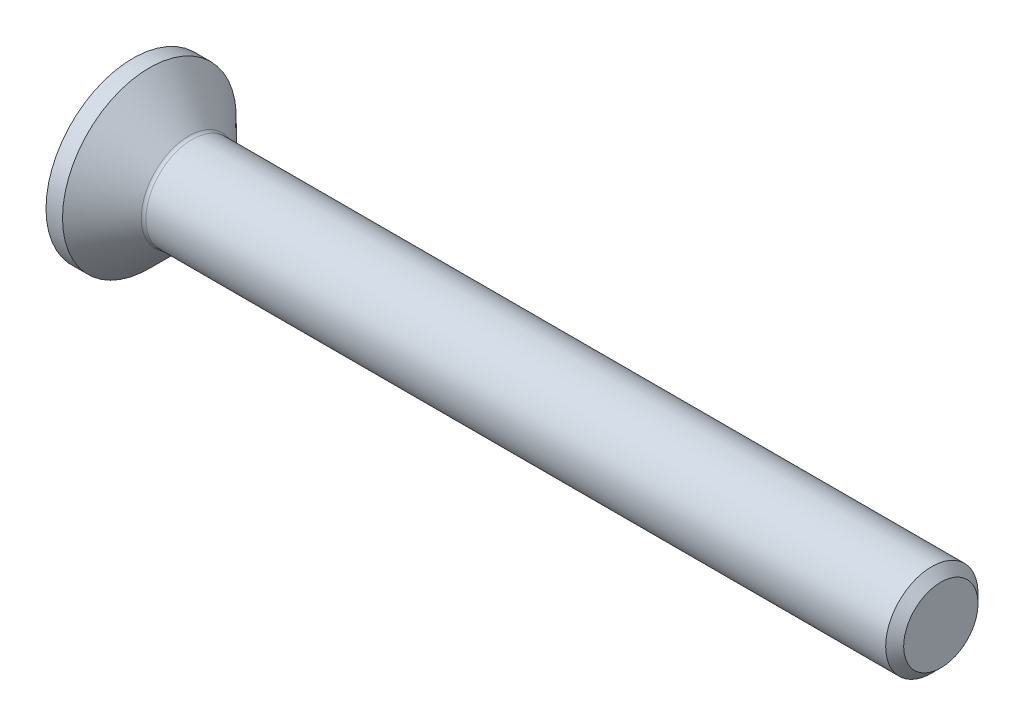
ISO-10303-21;
HEADER;
FILE_DESCRIPTION(('STEP AP214'),'2;1');
FILE_NAME('part.step','',(''),(''),'','','');
FILE_SCHEMA(('AUTOMOTIVE_DESIGN { 1 0 10303 214 1 1 1 1 }'));
ENDSEC;
DATA;
#1=APPLICATION_CONTEXT('core data for automotive mechanical design processes');
#2=APPLICATION_PROTOCOL_DEFINITION('international standard','automotive_design',2000,#1);
#3=PRODUCT_CONTEXT('',#1,'mechanical');
#4=PRODUCT('Part','Part','',(#3));
#5=PRODUCT_RELATED_PRODUCT_CATEGORY('part','',(#4));
#6=PRODUCT_DEFINITION_FORMATION('','',#4);
#7=PRODUCT_DEFINITION_CONTEXT('part definition',#1,'design');
#8=PRODUCT_DEFINITION('design','',#6,#7);
#9=PRODUCT_DEFINITION_SHAPE('','',#8);
#10=(LENGTH_UNIT() NAMED_UNIT(*) SI_UNIT(.MILLI.,.METRE.));
#11=(NAMED_UNIT(*) PLANE_ANGLE_UNIT() SI_UNIT($,.RADIAN.));
#12=(NAMED_UNIT(*) SI_UNIT($,.STERADIAN.) SOLID_ANGLE_UNIT());
#13=UNCERTAINTY_MEASURE_WITH_UNIT(LENGTH_MEASURE(1.E-05),#10,'distance_accuracy_value','');
#14=(GEOMETRIC_REPRESENTATION_CONTEXT(3) GLOBAL_UNCERTAINTY_ASSIGNED_CONTEXT((#13)) GLOBAL_UNIT_ASSIGNED_CONTEXT((#10,
#11,#12)) REPRESENTATION_CONTEXT('',''));
#15=CARTESIAN_POINT('',(0.,0.,0.));
#16=DIRECTION('',(0.,0.,1.));
#17=DIRECTION('',(1.,0.,0.));
#18=AXIS2_PLACEMENT_3D('',#15,#16,#17);
#19=CARTESIAN_POINT('',(0.,0.,0.));
#20=DIRECTION('',(-1.,0.,0.));
#21=DIRECTION('',(0.,0.,1.));
#22=AXIS2_PLACEMENT_3D('',#19,#20,#21);
#23=PLANE('',#22);
#24=CARTESIAN_POINT('',(0.,0.,0.));
#25=DIRECTION('',(-1.,0.,0.));
#26=DIRECTION('',(0.,0.,1.));
#27=AXIS2_PLACEMENT_3D('',#24,#25,#26);
#28=CIRCLE('',#27,3.765);
#29=CARTESIAN_POINT('',(0.,0.,3.765));
#30=VERTEX_POINT('',#29);
#31=EDGE_CURVE('E153',#30,#30,#28,.T.);
#32=ORIENTED_EDGE('',*,*,#31,.T.);
#33=EDGE_LOOP('',(#32));
#34=FACE_BOUND('',#33,.T.);
#35=DIRECTION('',(0.,-0.5,-0.866025403784439));
#36=VECTOR('',#35,1.);
#37=CARTESIAN_POINT('',(0.,-0.721687836487032,1.25));
#38=LINE('',#37,#36);
#39=CARTESIAN_POINT('',(0.,-0.721687836487032,1.25));
#40=VERTEX_POINT('',#39);
#41=CARTESIAN_POINT('',(0.,-1.44337567297406,0.));
#42=VERTEX_POINT('',#41);
#43=EDGE_CURVE('E119',#40,#42,#38,.T.);
#44=ORIENTED_EDGE('',*,*,#43,.T.);
#45=DIRECTION('',(0.,0.5,-0.866025403784439));
#46=VECTOR('',#45,1.);
#47=CARTESIAN_POINT('',(0.,-1.44337567297406,0.));
#48=LINE('',#47,#46);
#49=CARTESIAN_POINT('',(0.,-0.721687836487032,-1.25));
#50=VERTEX_POINT('',#49);
#51=EDGE_CURVE('E50',#42,#50,#48,.T.);
#52=ORIENTED_EDGE('',*,*,#51,.T.);
#53=DIRECTION('',(0.,1.,0.));
#54=VECTOR('',#53,1.);
#55=CARTESIAN_POINT('',(0.,-0.721687836487032,-1.25));
#56=LINE('',#55,#54);
#57=CARTESIAN_POINT('',(0.,0.721687836487032,-1.25));
#58=VERTEX_POINT('',#57);
#59=EDGE_CURVE('E130',#50,#58,#56,.T.);
#60=ORIENTED_EDGE('',*,*,#59,.T.);
#61=DIRECTION('',(0.,0.5,0.866025403784438));
#62=VECTOR('',#61,1.);
#63=CARTESIAN_POINT('',(0.,0.721687836487032,-1.25));
#64=LINE('',#63,#62);
#65=CARTESIAN_POINT('',(0.,1.44337567297407,0.));
#66=VERTEX_POINT('',#65);
#67=EDGE_CURVE('E254',#58,#66,#64,.T.);
#68=ORIENTED_EDGE('',*,*,#67,.T.);
#69=DIRECTION('',(0.,-0.5,0.866025403784438));
#70=VECTOR('',#69,1.);
#71=CARTESIAN_POINT('',(0.,1.44337567297407,0.));
#72=LINE('',#71,#70);
#73=CARTESIAN_POINT('',(0.,0.721687836487032,1.25));
#74=VERTEX_POINT('',#73);
#75=EDGE_CURVE('E257',#66,#74,#72,.T.);
#76=ORIENTED_EDGE('',*,*,#75,.T.);
#77=DIRECTION('',(0.,-1.,0.));
#78=VECTOR('',#77,1.);
#79=CARTESIAN_POINT('',(0.,0.721687836487032,1.25));
#80=LINE('',#79,#78);
#81=EDGE_CURVE('E260',#74,#40,#80,.T.);
#82=ORIENTED_EDGE('',*,*,#81,.T.);
#83=EDGE_LOOP('',(#44,#52,#60,#68,#76,#82));
#84=FACE_BOUND('',#83,.T.);
#85=ADVANCED_FACE('F35',(#34,#84),#23,.T.);
#86=CARTESIAN_POINT('',(0.,0.,0.));
#87=DIRECTION('',(-1.,0.,0.));
#88=DIRECTION('',(0.,0.,1.));
#89=AXIS2_PLACEMENT_3D('',#86,#87,#88);
#90=CYLINDRICAL_SURFACE('',#89,3.765);
#91=CARTESIAN_POINT('',(0.715000000000008,0.,0.));
#92=DIRECTION('',(-1.,0.,0.));
#93=DIRECTION('',(0.,0.,1.));
#94=AXIS2_PLACEMENT_3D('',#91,#92,#93);
#95=CIRCLE('',#94,3.765);
#96=CARTESIAN_POINT('',(0.715000000000008,0.,3.765));
#97=VERTEX_POINT('',#96);
#98=EDGE_CURVE('E150',#97,#97,#95,.T.);
#99=ORIENTED_EDGE('',*,*,#98,.T.);
#100=EDGE_LOOP('',(#99));
#101=FACE_BOUND('',#100,.T.);
#102=ORIENTED_EDGE('',*,*,#31,.F.);
#103=EDGE_LOOP('',(#102));
#104=FACE_BOUND('',#103,.T.);
#105=ADVANCED_FACE('F174',(#101,#104),#90,.T.);
#106=CARTESIAN_POINT('',(0.715000000000008,0.,0.));
#107=DIRECTION('',(-1.,0.,0.));
#108=DIRECTION('',(0.,0.,1.));
#109=AXIS2_PLACEMENT_3D('',#106,#107,#108);
#110=CONICAL_SURFACE('',#109,3.765,0.78539816339745);
#111=CARTESIAN_POINT('',(2.42142135623742,0.,0.));
#112=DIRECTION('',(-1.,0.,0.));
#113=DIRECTION('',(0.,0.,1.));
#114=AXIS2_PLACEMENT_3D('',#111,#112,#113);
#115=CIRCLE('',#114,2.05857864376259);
#116=CARTESIAN_POINT('',(2.42142135623742,0.,2.05857864376259));
#117=VERTEX_POINT('',#116);
#118=EDGE_CURVE('E43',#117,#117,#115,.T.);
#119=ORIENTED_EDGE('',*,*,#118,.T.);
#120=EDGE_LOOP('',(#119));
#121=FACE_BOUND('',#120,.T.);
#122=ORIENTED_EDGE('',*,*,#98,.F.);
#123=EDGE_LOOP('',(#122));
#124=FACE_BOUND('',#123,.T.);
#125=ADVANCED_FACE('F158',(#121,#124),#110,.T.);
#126=CARTESIAN_POINT('',(0.,0.,0.));
#127=DIRECTION('',(-1.,0.,0.));
#128=DIRECTION('',(0.,0.,1.));
#129=AXIS2_PLACEMENT_3D('',#126,#127,#128);
#130=CYLINDRICAL_SURFACE('',#129,1.9999999999999);
#131=CARTESIAN_POINT('',(2.56284271247473,0.,0.));
#132=DIRECTION('',(-1.,0.,0.));
#133=DIRECTION('',(0.,0.,1.));
#134=AXIS2_PLACEMENT_3D('',#131,#132,#133);
#135=CIRCLE('',#134,1.9999999999999);
#136=CARTESIAN_POINT('',(2.56284271247473,0.,1.9999999999999));
#137=VERTEX_POINT('',#136);
#138=EDGE_CURVE('E11',#137,#137,#135,.F.);
#139=ORIENTED_EDGE('',*,*,#138,.T.);
#140=EDGE_LOOP('',(#139));
#141=FACE_BOUND('',#140,.T.);
#142=CARTESIAN_POINT('',(34.6099999999998,0.,0.));
#143=DIRECTION('',(-1.,0.,0.));
#144=DIRECTION('',(0.,0.,1.));
#145=AXIS2_PLACEMENT_3D('',#142,#143,#144);
#146=CIRCLE('',#145,1.99999999999979);
#147=CARTESIAN_POINT('',(34.6099999999998,0.,1.99999999999979));
#148=VERTEX_POINT('',#147);
#149=EDGE_CURVE('E147',#148,#148,#146,.T.);
#150=ORIENTED_EDGE('',*,*,#149,.T.);
#151=EDGE_LOOP('',(#150));
#152=FACE_BOUND('',#151,.T.);
#153=ADVANCED_FACE('F185',(#141,#152),#130,.T.);
#154=CARTESIAN_POINT('',(35.,0.,0.));
#155=DIRECTION('',(-1.,0.,0.));
#156=DIRECTION('',(0.,0.,1.));
#157=AXIS2_PLACEMENT_3D('',#154,#155,#156);
#158=CONICAL_SURFACE('',#157,1.61,0.785398163396919);
#159=ORIENTED_EDGE('',*,*,#149,.F.);
#160=EDGE_LOOP('',(#159));
#161=FACE_BOUND('',#160,.T.);
#162=CARTESIAN_POINT('',(35.,0.,0.));
#163=DIRECTION('',(-1.,0.,0.));
#164=DIRECTION('',(0.,0.,1.));
#165=AXIS2_PLACEMENT_3D('',#162,#163,#164);
#166=CIRCLE('',#165,1.61);
#167=CARTESIAN_POINT('',(35.,0.,1.61));
#168=VERTEX_POINT('',#167);
#169=EDGE_CURVE('E143',#168,#168,#166,.T.);
#170=ORIENTED_EDGE('',*,*,#169,.T.);
#171=EDGE_LOOP('',(#170));
#172=FACE_BOUND('',#171,.T.);
#173=ADVANCED_FACE('F169',(#161,#172),#158,.T.);
#174=CARTESIAN_POINT('',(35.,1.61,0.));
#175=DIRECTION('',(1.,0.,0.));
#176=DIRECTION('',(0.,0.,-1.));
#177=AXIS2_PLACEMENT_3D('',#174,#175,#176);
#178=PLANE('',#177);
#179=ORIENTED_EDGE('',*,*,#169,.F.);
#180=EDGE_LOOP('',(#179));
#181=FACE_BOUND('',#180,.T.);
#182=ADVANCED_FACE('F162',(#181),#178,.T.);
#183=CARTESIAN_POINT('',(2.56284271247473,0.,0.));
#184=DIRECTION('',(-1.,0.,0.));
#185=DIRECTION('',(0.,0.,1.));
#186=AXIS2_PLACEMENT_3D('',#183,#184,#185);
#187=TOROIDAL_SURFACE('',#186,2.1999999999999,0.2);
#188=ORIENTED_EDGE('',*,*,#138,.F.);
#189=EDGE_LOOP('',(#188));
#190=FACE_BOUND('',#189,.T.);
#191=ORIENTED_EDGE('',*,*,#118,.F.);
#192=EDGE_LOOP('',(#191));
#193=FACE_BOUND('',#192,.T.);
#194=ADVANCED_FACE('F37',(#190,#193),#187,.F.);
#195=CARTESIAN_POINT('',(1.5,-1.44337567297406,0.));
#196=DIRECTION('',(0.,0.866025403784439,0.5));
#197=DIRECTION('',(0.,-0.5,0.866025403784439));
#198=AXIS2_PLACEMENT_3D('',#195,#196,#197);
#199=PLANE('',#198);
#200=ORIENTED_EDGE('',*,*,#51,.F.);
#201=DIRECTION('',(-1.,0.,0.));
#202=VECTOR('',#201,1.);
#203=CARTESIAN_POINT('',(1.5,-1.44337567297406,0.));
#204=LINE('',#203,#202);
#205=CARTESIAN_POINT('',(1.5,-1.44337567297406,0.));
#206=VERTEX_POINT('',#205);
#207=EDGE_CURVE('E251',#206,#42,#204,.T.);
#208=ORIENTED_EDGE('',*,*,#207,.F.);
#209=DIRECTION('',(0.,0.5,-0.866025403784439));
#210=VECTOR('',#209,1.);
#211=CARTESIAN_POINT('',(1.5,-1.44337567297406,0.));
#212=LINE('',#211,#210);
#213=CARTESIAN_POINT('',(1.5,-1.08253175473055,-0.625));
#214=VERTEX_POINT('',#213);
#215=EDGE_CURVE('E115',#206,#214,#212,.T.);
#216=ORIENTED_EDGE('',*,*,#215,.T.);
#217=CARTESIAN_POINT('',(1.5,-0.721687836487032,-1.25));
#218=VERTEX_POINT('',#217);
#219=EDGE_CURVE('E111',#214,#218,#212,.T.);
#220=ORIENTED_EDGE('',*,*,#219,.T.);
#221=DIRECTION('',(-1.,0.,0.));
#222=VECTOR('',#221,1.);
#223=CARTESIAN_POINT('',(1.5,-0.721687836487032,-1.25));
#224=LINE('',#223,#222);
#225=EDGE_CURVE('E113',#218,#50,#224,.T.);
#226=ORIENTED_EDGE('',*,*,#225,.T.);
#227=EDGE_LOOP('',(#200,#208,#216,#220,#226));
#228=FACE_BOUND('',#227,.T.);
#229=ADVANCED_FACE('F112',(#228),#199,.T.);
#230=CARTESIAN_POINT('',(1.5,-0.721687836487032,-1.25));
#231=DIRECTION('',(0.,0.,1.));
#232=DIRECTION('',(0.,-1.,0.));
#233=AXIS2_PLACEMENT_3D('',#230,#231,#232);
#234=PLANE('',#233);
#235=ORIENTED_EDGE('',*,*,#59,.F.);
#236=ORIENTED_EDGE('',*,*,#225,.F.);
#237=DIRECTION('',(0.,1.,0.));
#238=VECTOR('',#237,1.);
#239=CARTESIAN_POINT('',(1.5,-0.721687836487032,-1.25));
#240=LINE('',#239,#238);
#241=CARTESIAN_POINT('',(1.5,0.,-1.25));
#242=VERTEX_POINT('',#241);
#243=EDGE_CURVE('E58',#218,#242,#240,.T.);
#244=ORIENTED_EDGE('',*,*,#243,.T.);
#245=CARTESIAN_POINT('',(1.5,0.721687836487032,-1.25));
#246=VERTEX_POINT('',#245);
#247=EDGE_CURVE('E125',#242,#246,#240,.T.);
#248=ORIENTED_EDGE('',*,*,#247,.T.);
#249=DIRECTION('',(-1.,0.,0.));
#250=VECTOR('',#249,1.);
#251=CARTESIAN_POINT('',(1.5,0.721687836487032,-1.25));
#252=LINE('',#251,#250);
#253=EDGE_CURVE('E132',#246,#58,#252,.T.);
#254=ORIENTED_EDGE('',*,*,#253,.T.);
#255=EDGE_LOOP('',(#235,#236,#244,#248,#254));
#256=FACE_BOUND('',#255,.T.);
#257=ADVANCED_FACE('F127',(#256),#234,.T.);
#258=CARTESIAN_POINT('',(1.5,0.721687836487032,-1.25));
#259=DIRECTION('',(0.,-0.866025403784438,0.5));
#260=DIRECTION('',(0.,-0.5,-0.866025403784438));
#261=AXIS2_PLACEMENT_3D('',#258,#259,#260);
#262=PLANE('',#261);
#263=ORIENTED_EDGE('',*,*,#67,.F.);
#264=ORIENTED_EDGE('',*,*,#253,.F.);
#265=DIRECTION('',(0.,0.5,0.866025403784438));
#266=VECTOR('',#265,1.);
#267=CARTESIAN_POINT('',(1.5,0.721687836487032,-1.25));
#268=LINE('',#267,#266);
#269=CARTESIAN_POINT('',(1.5,1.08253175473055,-0.625000000000001));
#270=VERTEX_POINT('',#269);
#271=EDGE_CURVE('E232',#246,#270,#268,.T.);
#272=ORIENTED_EDGE('',*,*,#271,.T.);
#273=CARTESIAN_POINT('',(1.5,1.44337567297407,0.));
#274=VERTEX_POINT('',#273);
#275=EDGE_CURVE('E124',#270,#274,#268,.T.);
#276=ORIENTED_EDGE('',*,*,#275,.T.);
#277=DIRECTION('',(-1.,0.,0.));
#278=VECTOR('',#277,1.);
#279=CARTESIAN_POINT('',(1.5,1.44337567297407,0.));
#280=LINE('',#279,#278);
#281=EDGE_CURVE('E138',#274,#66,#280,.T.);
#282=ORIENTED_EDGE('',*,*,#281,.T.);
#283=EDGE_LOOP('',(#263,#264,#272,#276,#282));
#284=FACE_BOUND('',#283,.T.);
#285=ADVANCED_FACE('F199',(#284),#262,.T.);
#286=CARTESIAN_POINT('',(1.5,1.44337567297407,0.));
#287=DIRECTION('',(0.,-0.866025403784438,-0.5));
#288=DIRECTION('',(0.,0.5,-0.866025403784438));
#289=AXIS2_PLACEMENT_3D('',#286,#287,#288);
#290=PLANE('',#289);
#291=ORIENTED_EDGE('',*,*,#75,.F.);
#292=ORIENTED_EDGE('',*,*,#281,.F.);
#293=DIRECTION('',(0.,-0.5,0.866025403784438));
#294=VECTOR('',#293,1.);
#295=CARTESIAN_POINT('',(1.5,1.44337567297407,0.));
#296=LINE('',#295,#294);
#297=CARTESIAN_POINT('',(1.5,1.08253175473055,0.625000000000001));
#298=VERTEX_POINT('',#297);
#299=EDGE_CURVE('E239',#274,#298,#296,.T.);
#300=ORIENTED_EDGE('',*,*,#299,.T.);
#301=CARTESIAN_POINT('',(1.5,0.721687836487032,1.25));
#302=VERTEX_POINT('',#301);
#303=EDGE_CURVE('E237',#298,#302,#296,.T.);
#304=ORIENTED_EDGE('',*,*,#303,.T.);
#305=DIRECTION('',(-1.,0.,0.));
#306=VECTOR('',#305,1.);
#307=CARTESIAN_POINT('',(1.5,0.721687836487032,1.25));
#308=LINE('',#307,#306);
#309=EDGE_CURVE('E269',#302,#74,#308,.T.);
#310=ORIENTED_EDGE('',*,*,#309,.T.);
#311=EDGE_LOOP('',(#291,#292,#300,#304,#310));
#312=FACE_BOUND('',#311,.T.);
#313=ADVANCED_FACE('F202',(#312),#290,.T.);
#314=CARTESIAN_POINT('',(1.5,0.721687836487032,1.25));
#315=DIRECTION('',(0.,0.,-1.));
#316=DIRECTION('',(-1.,0.,0.));
#317=AXIS2_PLACEMENT_3D('',#314,#315,#316);
#318=PLANE('',#317);
#319=ORIENTED_EDGE('',*,*,#81,.F.);
#320=ORIENTED_EDGE('',*,*,#309,.F.);
#321=DIRECTION('',(0.,-1.,0.));
#322=VECTOR('',#321,1.);
#323=CARTESIAN_POINT('',(1.5,0.721687836487032,1.25));
#324=LINE('',#323,#322);
#325=CARTESIAN_POINT('',(1.5,0.,1.25));
#326=VERTEX_POINT('',#325);
#327=EDGE_CURVE('E244',#302,#326,#324,.T.);
#328=ORIENTED_EDGE('',*,*,#327,.T.);
#329=CARTESIAN_POINT('',(1.5,-0.721687836487032,1.25));
#330=VERTEX_POINT('',#329);
#331=EDGE_CURVE('E243',#326,#330,#324,.T.);
#332=ORIENTED_EDGE('',*,*,#331,.T.);
#333=DIRECTION('',(-1.,0.,0.));
#334=VECTOR('',#333,1.);
#335=CARTESIAN_POINT('',(1.5,-0.721687836487032,1.25));
#336=LINE('',#335,#334);
#337=EDGE_CURVE('E266',#330,#40,#336,.T.);
#338=ORIENTED_EDGE('',*,*,#337,.T.);
#339=EDGE_LOOP('',(#319,#320,#328,#332,#338));
#340=FACE_BOUND('',#339,.T.);
#341=ADVANCED_FACE('F206',(#340),#318,.T.);
#342=CARTESIAN_POINT('',(1.5,-0.721687836487032,1.25));
#343=DIRECTION('',(0.,0.866025403784439,-0.5));
#344=DIRECTION('',(0.,0.5,0.866025403784439));
#345=AXIS2_PLACEMENT_3D('',#342,#343,#344);
#346=PLANE('',#345);
#347=ORIENTED_EDGE('',*,*,#43,.F.);
#348=ORIENTED_EDGE('',*,*,#337,.F.);
#349=DIRECTION('',(0.,-0.5,-0.866025403784439));
#350=VECTOR('',#349,1.);
#351=CARTESIAN_POINT('',(1.5,-0.721687836487032,1.25));
#352=LINE('',#351,#350);
#353=CARTESIAN_POINT('',(1.5,-1.08253175473055,0.625000000000001));
#354=VERTEX_POINT('',#353);
#355=EDGE_CURVE('E248',#330,#354,#352,.T.);
#356=ORIENTED_EDGE('',*,*,#355,.T.);
#357=EDGE_CURVE('E247',#354,#206,#352,.T.);
#358=ORIENTED_EDGE('',*,*,#357,.T.);
#359=ORIENTED_EDGE('',*,*,#207,.T.);
#360=EDGE_LOOP('',(#347,#348,#356,#358,#359));
#361=FACE_BOUND('',#360,.T.);
#362=ADVANCED_FACE('F210',(#361),#346,.T.);
#363=CARTESIAN_POINT('',(1.5,0.,-2.5));
#364=DIRECTION('',(1.,0.,0.));
#365=DIRECTION('',(0.,0.,-1.));
#366=AXIS2_PLACEMENT_3D('',#363,#364,#365);
#367=PLANE('',#366);
#368=ORIENTED_EDGE('',*,*,#243,.F.);
#369=ORIENTED_EDGE('',*,*,#219,.F.);
#370=CARTESIAN_POINT('',(1.5,0.,0.));
#371=DIRECTION('',(-1.,0.,0.));
#372=DIRECTION('',(0.,0.,1.));
#373=AXIS2_PLACEMENT_3D('',#370,#371,#372);
#374=CIRCLE('',#373,1.25);
#375=EDGE_CURVE('E122',#242,#214,#374,.T.);
#376=ORIENTED_EDGE('',*,*,#375,.F.);
#377=EDGE_LOOP('',(#368,#369,#376));
#378=FACE_BOUND('',#377,.T.);
#379=ADVANCED_FACE('F121',(#378),#367,.F.);
#380=ORIENTED_EDGE('',*,*,#215,.F.);
#381=ORIENTED_EDGE('',*,*,#357,.F.);
#382=EDGE_CURVE('E135',#214,#354,#374,.T.);
#383=ORIENTED_EDGE('',*,*,#382,.F.);
#384=EDGE_LOOP('',(#380,#381,#383));
#385=FACE_BOUND('',#384,.T.);
#386=ADVANCED_FACE('F216',(#385),#367,.F.);
#387=ORIENTED_EDGE('',*,*,#355,.F.);
#388=ORIENTED_EDGE('',*,*,#331,.F.);
#389=EDGE_CURVE('E131',#354,#326,#374,.T.);
#390=ORIENTED_EDGE('',*,*,#389,.F.);
#391=EDGE_LOOP('',(#387,#388,#390));
#392=FACE_BOUND('',#391,.T.);
#393=ADVANCED_FACE('F220',(#392),#367,.F.);
#394=ORIENTED_EDGE('',*,*,#327,.F.);
#395=ORIENTED_EDGE('',*,*,#303,.F.);
#396=EDGE_CURVE('E137',#326,#298,#374,.T.);
#397=ORIENTED_EDGE('',*,*,#396,.F.);
#398=EDGE_LOOP('',(#394,#395,#397));
#399=FACE_BOUND('',#398,.T.);
#400=ADVANCED_FACE('F228',(#399),#367,.F.);
#401=ORIENTED_EDGE('',*,*,#299,.F.);
#402=ORIENTED_EDGE('',*,*,#275,.F.);
#403=EDGE_CURVE('E144',#298,#270,#374,.T.);
#404=ORIENTED_EDGE('',*,*,#403,.F.);
#405=EDGE_LOOP('',(#401,#402,#404));
#406=FACE_BOUND('',#405,.T.);
#407=ADVANCED_FACE('F223',(#406),#367,.F.);
#408=ORIENTED_EDGE('',*,*,#271,.F.);
#409=ORIENTED_EDGE('',*,*,#247,.F.);
#410=EDGE_CURVE('E233',#270,#242,#374,.T.);
#411=ORIENTED_EDGE('',*,*,#410,.F.);
#412=EDGE_LOOP('',(#408,#409,#411));
#413=FACE_BOUND('',#412,.T.);
#414=ADVANCED_FACE('F194',(#413),#367,.F.);
#415=CARTESIAN_POINT('',(1.5,0.,0.));
#416=DIRECTION('',(-1.,0.,0.));
#417=DIRECTION('',(0.,0.,1.));
#418=AXIS2_PLACEMENT_3D('',#415,#416,#417);
#419=CONICAL_SURFACE('',#418,1.25,1.04719755119659);
#420=CARTESIAN_POINT('',(2.22168783648704,0.,0.));
#421=VERTEX_POINT('',#420);
#422=VERTEX_LOOP('',#421);
#423=FACE_BOUND('',#422,.T.);
#424=ORIENTED_EDGE('',*,*,#396,.T.);
#425=ORIENTED_EDGE('',*,*,#403,.T.);
#426=ORIENTED_EDGE('',*,*,#410,.T.);
#427=ORIENTED_EDGE('',*,*,#375,.T.);
#428=ORIENTED_EDGE('',*,*,#382,.T.);
#429=ORIENTED_EDGE('',*,*,#389,.T.);
#430=EDGE_LOOP('',(#424,#425,#426,#427,#428,#429));
#431=FACE_BOUND('',#430,.T.);
#432=ADVANCED_FACE('F192',(#423,#431),#419,.F.);
#433=CLOSED_SHELL('',(#85,#105,#125,#153,#173,#182,#194,#229,#257,#285,#313,#341,#362,#379,#386,
#393,#400,#407,#414,#432));
#434=MANIFOLD_SOLID_BREP('B2',#433);
#435=ADVANCED_BREP_SHAPE_REPRESENTATION('',(#18,#434),#14);
#436=SHAPE_DEFINITION_REPRESENTATION(#9,#435);
ENDSEC;
END-ISO-10303-21;
